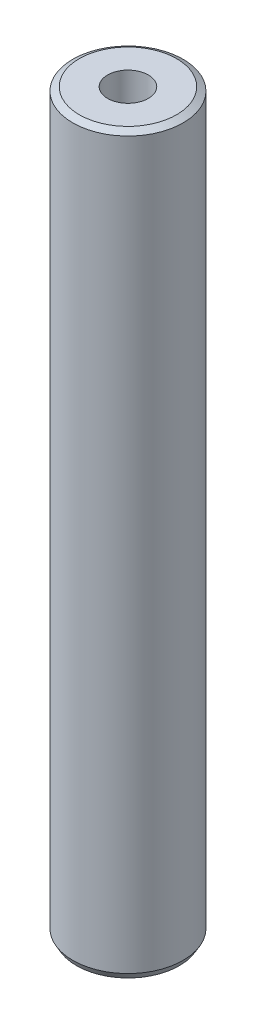
ISO-10303-21;
HEADER;
FILE_DESCRIPTION(('STEP AP214'),'2;1');
FILE_NAME('part.step','',(''),(''),'','','');
FILE_SCHEMA(('AUTOMOTIVE_DESIGN { 1 0 10303 214 1 1 1 1 }'));
ENDSEC;
DATA;
#1=APPLICATION_CONTEXT('core data for automotive mechanical design processes');
#2=APPLICATION_PROTOCOL_DEFINITION('international standard','automotive_design',2000,#1);
#3=PRODUCT_CONTEXT('',#1,'mechanical');
#4=PRODUCT('Part','Part','',(#3));
#5=PRODUCT_RELATED_PRODUCT_CATEGORY('part','',(#4));
#6=PRODUCT_DEFINITION_FORMATION('','',#4);
#7=PRODUCT_DEFINITION_CONTEXT('part definition',#1,'design');
#8=PRODUCT_DEFINITION('design','',#6,#7);
#9=PRODUCT_DEFINITION_SHAPE('','',#8);
#10=(LENGTH_UNIT() NAMED_UNIT(*) SI_UNIT(.MILLI.,.METRE.));
#11=(NAMED_UNIT(*) PLANE_ANGLE_UNIT() SI_UNIT($,.RADIAN.));
#12=(NAMED_UNIT(*) SI_UNIT($,.STERADIAN.) SOLID_ANGLE_UNIT());
#13=UNCERTAINTY_MEASURE_WITH_UNIT(LENGTH_MEASURE(1.E-05),#10,'distance_accuracy_value','');
#14=(GEOMETRIC_REPRESENTATION_CONTEXT(3) GLOBAL_UNCERTAINTY_ASSIGNED_CONTEXT((#13)) GLOBAL_UNIT_ASSIGNED_CONTEXT((#10,
#11,#12)) REPRESENTATION_CONTEXT('',''));
#15=CARTESIAN_POINT('',(0.,0.,0.));
#16=DIRECTION('',(0.,0.,1.));
#17=DIRECTION('',(1.,0.,0.));
#18=AXIS2_PLACEMENT_3D('',#15,#16,#17);
#19=CARTESIAN_POINT('',(0.,600.,0.));
#20=DIRECTION('',(0.,-1.,0.));
#21=DIRECTION('',(0.,0.,-1.));
#22=AXIS2_PLACEMENT_3D('',#19,#20,#21);
#23=CYLINDRICAL_SURFACE('',#22,45.);
#24=CARTESIAN_POINT('',(0.,596.927233015067,0.));
#25=DIRECTION('',(0.,1.,0.));
#26=DIRECTION('',(0.,0.,1.));
#27=AXIS2_PLACEMENT_3D('',#24,#25,#26);
#28=CIRCLE('',#27,45.);
#29=CARTESIAN_POINT('',(0.,596.927233015067,45.));
#30=VERTEX_POINT('',#29);
#31=EDGE_CURVE('E50',#30,#30,#28,.F.);
#32=ORIENTED_EDGE('',*,*,#31,.T.);
#33=EDGE_LOOP('',(#32));
#34=FACE_BOUND('',#33,.T.);
#35=CARTESIAN_POINT('',(0.,5.32218853772448,0.));
#36=DIRECTION('',(0.,1.,0.));
#37=DIRECTION('',(0.,0.,1.));
#38=AXIS2_PLACEMENT_3D('',#35,#36,#37);
#39=CIRCLE('',#38,45.);
#40=CARTESIAN_POINT('',(0.,5.32218853772448,45.));
#41=VERTEX_POINT('',#40);
#42=EDGE_CURVE('E51',#41,#41,#39,.T.);
#43=ORIENTED_EDGE('',*,*,#42,.T.);
#44=EDGE_LOOP('',(#43));
#45=FACE_BOUND('',#44,.T.);
#46=ADVANCED_FACE('F39',(#34,#45),#23,.T.);
#47=CARTESIAN_POINT('',(0.,600.,0.));
#48=DIRECTION('',(0.,1.,0.));
#49=DIRECTION('',(0.,0.,1.));
#50=AXIS2_PLACEMENT_3D('',#47,#48,#49);
#51=PLANE('',#50);
#52=CARTESIAN_POINT('',(0.,600.,0.));
#53=DIRECTION('',(0.,1.,0.));
#54=DIRECTION('',(0.,0.,1.));
#55=AXIS2_PLACEMENT_3D('',#52,#53,#54);
#56=CIRCLE('',#55,39.6778114622757);
#57=CARTESIAN_POINT('',(0.,600.,39.6778114622757));
#58=VERTEX_POINT('',#57);
#59=EDGE_CURVE('E54',#58,#58,#56,.T.);
#60=ORIENTED_EDGE('',*,*,#59,.T.);
#61=EDGE_LOOP('',(#60));
#62=FACE_BOUND('',#61,.T.);
#63=CARTESIAN_POINT('',(0.,600.,0.));
#64=DIRECTION('',(0.,1.,0.));
#65=DIRECTION('',(0.,0.,1.));
#66=AXIS2_PLACEMENT_3D('',#63,#64,#65);
#67=CIRCLE('',#66,16.6191190309887);
#68=CARTESIAN_POINT('',(0.,600.,16.6191190309887));
#69=VERTEX_POINT('',#68);
#70=EDGE_CURVE('E58',#69,#69,#67,.T.);
#71=ORIENTED_EDGE('',*,*,#70,.F.);
#72=EDGE_LOOP('',(#71));
#73=FACE_BOUND('',#72,.T.);
#74=ADVANCED_FACE('F69',(#62,#73),#51,.T.);
#75=CARTESIAN_POINT('',(0.,0.,0.));
#76=DIRECTION('',(0.,1.,0.));
#77=DIRECTION('',(0.,0.,1.));
#78=AXIS2_PLACEMENT_3D('',#75,#76,#77);
#79=PLANE('',#78);
#80=CARTESIAN_POINT('',(0.,0.,0.));
#81=DIRECTION('',(0.,1.,0.));
#82=DIRECTION('',(0.,0.,1.));
#83=AXIS2_PLACEMENT_3D('',#80,#81,#82);
#84=CIRCLE('',#83,41.9272330150668);
#85=CARTESIAN_POINT('',(0.,0.,41.9272330150668));
#86=VERTEX_POINT('',#85);
#87=EDGE_CURVE('E10',#86,#86,#84,.F.);
#88=ORIENTED_EDGE('',*,*,#87,.T.);
#89=EDGE_LOOP('',(#88));
#90=FACE_BOUND('',#89,.T.);
#91=CARTESIAN_POINT('',(0.,0.,0.));
#92=DIRECTION('',(0.,1.,0.));
#93=DIRECTION('',(0.,0.,1.));
#94=AXIS2_PLACEMENT_3D('',#91,#92,#93);
#95=CIRCLE('',#94,16.6191190309887);
#96=CARTESIAN_POINT('',(0.,0.,16.6191190309887));
#97=VERTEX_POINT('',#96);
#98=EDGE_CURVE('E63',#97,#97,#95,.T.);
#99=ORIENTED_EDGE('',*,*,#98,.T.);
#100=EDGE_LOOP('',(#99));
#101=FACE_BOUND('',#100,.T.);
#102=ADVANCED_FACE('F75',(#90,#101),#79,.F.);
#103=CARTESIAN_POINT('',(0.,600.,0.));
#104=DIRECTION('',(0.,-1.,0.));
#105=DIRECTION('',(0.,0.,-1.));
#106=AXIS2_PLACEMENT_3D('',#103,#104,#105);
#107=CYLINDRICAL_SURFACE('',#106,16.6191190309887);
#108=ORIENTED_EDGE('',*,*,#70,.T.);
#109=EDGE_LOOP('',(#108));
#110=FACE_BOUND('',#109,.T.);
#111=ORIENTED_EDGE('',*,*,#98,.F.);
#112=EDGE_LOOP('',(#111));
#113=FACE_BOUND('',#112,.T.);
#114=ADVANCED_FACE('F70',(#110,#113),#107,.F.);
#115=CARTESIAN_POINT('',(0.,600.,0.));
#116=DIRECTION('',(0.,-1.,0.));
#117=DIRECTION('',(0.,0.,-1.));
#118=AXIS2_PLACEMENT_3D('',#115,#116,#117);
#119=CONICAL_SURFACE('',#118,39.6778114622757,1.0471975511966);
#120=ORIENTED_EDGE('',*,*,#31,.F.);
#121=EDGE_LOOP('',(#120));
#122=FACE_BOUND('',#121,.T.);
#123=ORIENTED_EDGE('',*,*,#59,.F.);
#124=EDGE_LOOP('',(#123));
#125=FACE_BOUND('',#124,.T.);
#126=ADVANCED_FACE('F81',(#122,#125),#119,.T.);
#127=CARTESIAN_POINT('',(0.,5.32218853772448,0.));
#128=DIRECTION('',(0.,1.,0.));
#129=DIRECTION('',(0.,0.,1.));
#130=AXIS2_PLACEMENT_3D('',#127,#128,#129);
#131=CONICAL_SURFACE('',#130,45.,0.523598775598305);
#132=ORIENTED_EDGE('',*,*,#87,.F.);
#133=EDGE_LOOP('',(#132));
#134=FACE_BOUND('',#133,.T.);
#135=ORIENTED_EDGE('',*,*,#42,.F.);
#136=EDGE_LOOP('',(#135));
#137=FACE_BOUND('',#136,.T.);
#138=ADVANCED_FACE('F45',(#134,#137),#131,.T.);
#139=CLOSED_SHELL('',(#46,#74,#102,#114,#126,#138));
#140=MANIFOLD_SOLID_BREP('B2',#139);
#141=ADVANCED_BREP_SHAPE_REPRESENTATION('',(#18,#140),#14);
#142=SHAPE_DEFINITION_REPRESENTATION(#9,#141);
ENDSEC;
END-ISO-10303-21;
